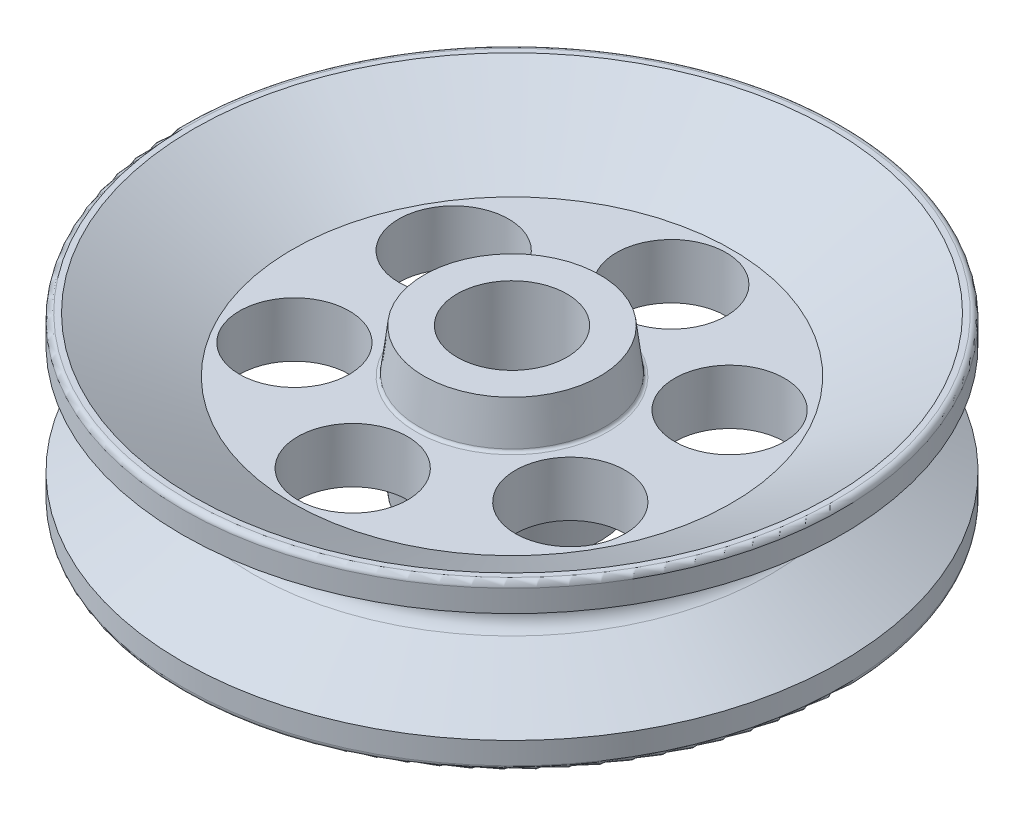
ISO-10303-21;
HEADER;
FILE_DESCRIPTION(('STEP AP214'),'2;1');
FILE_NAME('part.step','',(''),(''),'','','');
FILE_SCHEMA(('AUTOMOTIVE_DESIGN { 1 0 10303 214 1 1 1 1 }'));
ENDSEC;
DATA;
#1=APPLICATION_CONTEXT('core data for automotive mechanical design processes');
#2=APPLICATION_PROTOCOL_DEFINITION('international standard','automotive_design',2000,#1);
#3=PRODUCT_CONTEXT('',#1,'mechanical');
#4=PRODUCT('Part','Part','',(#3));
#5=PRODUCT_RELATED_PRODUCT_CATEGORY('part','',(#4));
#6=PRODUCT_DEFINITION_FORMATION('','',#4);
#7=PRODUCT_DEFINITION_CONTEXT('part definition',#1,'design');
#8=PRODUCT_DEFINITION('design','',#6,#7);
#9=PRODUCT_DEFINITION_SHAPE('','',#8);
#10=(LENGTH_UNIT() NAMED_UNIT(*) SI_UNIT(.MILLI.,.METRE.));
#11=(NAMED_UNIT(*) PLANE_ANGLE_UNIT() SI_UNIT($,.RADIAN.));
#12=(NAMED_UNIT(*) SI_UNIT($,.STERADIAN.) SOLID_ANGLE_UNIT());
#13=UNCERTAINTY_MEASURE_WITH_UNIT(LENGTH_MEASURE(1.E-05),#10,'distance_accuracy_value','');
#14=(GEOMETRIC_REPRESENTATION_CONTEXT(3) GLOBAL_UNCERTAINTY_ASSIGNED_CONTEXT((#13)) GLOBAL_UNIT_ASSIGNED_CONTEXT((#10,
#11,#12)) REPRESENTATION_CONTEXT('',''));
#15=CARTESIAN_POINT('',(0.,0.,0.));
#16=DIRECTION('',(0.,0.,1.));
#17=DIRECTION('',(1.,0.,0.));
#18=AXIS2_PLACEMENT_3D('',#15,#16,#17);
#19=CARTESIAN_POINT('',(0.,-381.,0.));
#20=DIRECTION('',(0.,1.,0.));
#21=DIRECTION('',(0.,0.,1.));
#22=AXIS2_PLACEMENT_3D('',#19,#20,#21);
#23=CYLINDRICAL_SURFACE('',#22,254.);
#24=CARTESIAN_POINT('',(0.,-330.2,0.));
#25=DIRECTION('',(0.,-1.,0.));
#26=DIRECTION('',(0.,0.,-1.));
#27=AXIS2_PLACEMENT_3D('',#24,#25,#26);
#28=CIRCLE('',#27,254.);
#29=CARTESIAN_POINT('',(0.,-330.2,-254.));
#30=VERTEX_POINT('',#29);
#31=EDGE_CURVE('E76',#30,#30,#28,.F.);
#32=ORIENTED_EDGE('',*,*,#31,.F.);
#33=EDGE_LOOP('',(#32));
#34=FACE_BOUND('',#33,.T.);
#35=CARTESIAN_POINT('',(0.,330.2,0.));
#36=DIRECTION('',(0.,1.,0.));
#37=DIRECTION('',(0.,0.,1.));
#38=AXIS2_PLACEMENT_3D('',#35,#36,#37);
#39=CIRCLE('',#38,254.);
#40=CARTESIAN_POINT('',(0.,330.2,254.));
#41=VERTEX_POINT('',#40);
#42=EDGE_CURVE('E64',#41,#41,#39,.F.);
#43=ORIENTED_EDGE('',*,*,#42,.F.);
#44=EDGE_LOOP('',(#43));
#45=FACE_BOUND('',#44,.T.);
#46=ADVANCED_FACE('F39',(#34,#45),#23,.F.);
#47=CARTESIAN_POINT('',(0.,-381.,-736.6));
#48=DIRECTION('',(0.,1.,0.));
#49=DIRECTION('',(0.,0.,1.));
#50=AXIS2_PLACEMENT_3D('',#47,#48,#49);
#51=CYLINDRICAL_SURFACE('',#50,254.);
#52=CARTESIAN_POINT('',(0.,-127.,-736.6));
#53=DIRECTION('',(0.,-1.,0.));
#54=DIRECTION('',(0.,0.,-1.));
#55=AXIS2_PLACEMENT_3D('',#52,#53,#54);
#56=CIRCLE('',#55,254.);
#57=CARTESIAN_POINT('',(0.,-127.,-990.6));
#58=VERTEX_POINT('',#57);
#59=EDGE_CURVE('E81',#58,#58,#56,.F.);
#60=ORIENTED_EDGE('',*,*,#59,.F.);
#61=EDGE_LOOP('',(#60));
#62=FACE_BOUND('',#61,.T.);
#63=CARTESIAN_POINT('',(0.,127.,-736.6));
#64=DIRECTION('',(0.,1.,0.));
#65=DIRECTION('',(0.,0.,1.));
#66=AXIS2_PLACEMENT_3D('',#63,#64,#65);
#67=CIRCLE('',#66,254.);
#68=CARTESIAN_POINT('',(0.,127.,-482.6));
#69=VERTEX_POINT('',#68);
#70=EDGE_CURVE('E69',#69,#69,#67,.F.);
#71=ORIENTED_EDGE('',*,*,#70,.F.);
#72=EDGE_LOOP('',(#71));
#73=FACE_BOUND('',#72,.T.);
#74=ADVANCED_FACE('F197',(#62,#73),#51,.F.);
#75=CARTESIAN_POINT('',(-637.914312427618,-381.,-368.299999999999));
#76=DIRECTION('',(0.,1.,0.));
#77=DIRECTION('',(0.,0.,1.));
#78=AXIS2_PLACEMENT_3D('',#75,#76,#77);
#79=CYLINDRICAL_SURFACE('',#78,254.);
#80=CARTESIAN_POINT('',(-637.914312427618,-127.,-368.299999999999));
#81=DIRECTION('',(0.,-1.,0.));
#82=DIRECTION('',(0.,0.,-1.));
#83=AXIS2_PLACEMENT_3D('',#80,#81,#82);
#84=CIRCLE('',#83,254.);
#85=CARTESIAN_POINT('',(-637.914312427618,-127.,-622.299999999998));
#86=VERTEX_POINT('',#85);
#87=EDGE_CURVE('E105',#86,#86,#84,.F.);
#88=ORIENTED_EDGE('',*,*,#87,.F.);
#89=EDGE_LOOP('',(#88));
#90=FACE_BOUND('',#89,.T.);
#91=CARTESIAN_POINT('',(-637.914312427618,127.,-368.299999999999));
#92=DIRECTION('',(0.,1.,0.));
#93=DIRECTION('',(0.,0.,1.));
#94=AXIS2_PLACEMENT_3D('',#91,#92,#93);
#95=CIRCLE('',#94,254.);
#96=CARTESIAN_POINT('',(-637.914312427618,127.,-114.299999999999));
#97=VERTEX_POINT('',#96);
#98=EDGE_CURVE('E141',#97,#97,#95,.F.);
#99=ORIENTED_EDGE('',*,*,#98,.F.);
#100=EDGE_LOOP('',(#99));
#101=FACE_BOUND('',#100,.T.);
#102=ADVANCED_FACE('F199',(#90,#101),#79,.F.);
#103=CARTESIAN_POINT('',(637.914312427613,-381.,-368.300000000007));
#104=DIRECTION('',(0.,1.,0.));
#105=DIRECTION('',(0.,0.,1.));
#106=AXIS2_PLACEMENT_3D('',#103,#104,#105);
#107=CYLINDRICAL_SURFACE('',#106,254.);
#108=CARTESIAN_POINT('',(637.914312427613,-127.,-368.300000000007));
#109=DIRECTION('',(0.,-1.,0.));
#110=DIRECTION('',(0.,0.,-1.));
#111=AXIS2_PLACEMENT_3D('',#108,#109,#110);
#112=CIRCLE('',#111,254.);
#113=CARTESIAN_POINT('',(637.914312427613,-127.,-622.300000000007));
#114=VERTEX_POINT('',#113);
#115=EDGE_CURVE('E109',#114,#114,#112,.F.);
#116=ORIENTED_EDGE('',*,*,#115,.F.);
#117=EDGE_LOOP('',(#116));
#118=FACE_BOUND('',#117,.T.);
#119=CARTESIAN_POINT('',(637.914312427613,127.,-368.300000000007));
#120=DIRECTION('',(0.,1.,0.));
#121=DIRECTION('',(0.,0.,1.));
#122=AXIS2_PLACEMENT_3D('',#119,#120,#121);
#123=CIRCLE('',#122,254.);
#124=CARTESIAN_POINT('',(637.914312427613,127.,-114.300000000007));
#125=VERTEX_POINT('',#124);
#126=EDGE_CURVE('E145',#125,#125,#123,.F.);
#127=ORIENTED_EDGE('',*,*,#126,.F.);
#128=EDGE_LOOP('',(#127));
#129=FACE_BOUND('',#128,.T.);
#130=ADVANCED_FACE('F206',(#118,#129),#107,.F.);
#131=CARTESIAN_POINT('',(637.914312427621,-381.,368.299999999994));
#132=DIRECTION('',(0.,1.,0.));
#133=DIRECTION('',(0.,0.,1.));
#134=AXIS2_PLACEMENT_3D('',#131,#132,#133);
#135=CYLINDRICAL_SURFACE('',#134,254.);
#136=CARTESIAN_POINT('',(637.914312427621,-127.,368.299999999994));
#137=DIRECTION('',(0.,-1.,0.));
#138=DIRECTION('',(0.,0.,-1.));
#139=AXIS2_PLACEMENT_3D('',#136,#137,#138);
#140=CIRCLE('',#139,254.);
#141=CARTESIAN_POINT('',(637.914312427621,-127.,114.299999999994));
#142=VERTEX_POINT('',#141);
#143=EDGE_CURVE('E113',#142,#142,#140,.F.);
#144=ORIENTED_EDGE('',*,*,#143,.F.);
#145=EDGE_LOOP('',(#144));
#146=FACE_BOUND('',#145,.T.);
#147=CARTESIAN_POINT('',(637.914312427621,127.,368.299999999994));
#148=DIRECTION('',(0.,1.,0.));
#149=DIRECTION('',(0.,0.,1.));
#150=AXIS2_PLACEMENT_3D('',#147,#148,#149);
#151=CIRCLE('',#150,254.);
#152=CARTESIAN_POINT('',(637.914312427621,127.,622.299999999994));
#153=VERTEX_POINT('',#152);
#154=EDGE_CURVE('E149',#153,#153,#151,.F.);
#155=ORIENTED_EDGE('',*,*,#154,.F.);
#156=EDGE_LOOP('',(#155));
#157=FACE_BOUND('',#156,.T.);
#158=ADVANCED_FACE('F297',(#146,#157),#135,.F.);
#159=CARTESIAN_POINT('',(0.,-381.,736.6));
#160=DIRECTION('',(0.,1.,0.));
#161=DIRECTION('',(0.,0.,1.));
#162=AXIS2_PLACEMENT_3D('',#159,#160,#161);
#163=CYLINDRICAL_SURFACE('',#162,254.);
#164=CARTESIAN_POINT('',(0.,-127.,736.6));
#165=DIRECTION('',(0.,-1.,0.));
#166=DIRECTION('',(0.,0.,-1.));
#167=AXIS2_PLACEMENT_3D('',#164,#165,#166);
#168=CIRCLE('',#167,254.);
#169=CARTESIAN_POINT('',(0.,-127.,482.6));
#170=VERTEX_POINT('',#169);
#171=EDGE_CURVE('E86',#170,#170,#168,.F.);
#172=ORIENTED_EDGE('',*,*,#171,.F.);
#173=EDGE_LOOP('',(#172));
#174=FACE_BOUND('',#173,.T.);
#175=CARTESIAN_POINT('',(0.,127.,736.6));
#176=DIRECTION('',(0.,1.,0.));
#177=DIRECTION('',(0.,0.,1.));
#178=AXIS2_PLACEMENT_3D('',#175,#176,#177);
#179=CIRCLE('',#178,254.);
#180=CARTESIAN_POINT('',(0.,127.,990.6));
#181=VERTEX_POINT('',#180);
#182=EDGE_CURVE('E74',#181,#181,#179,.F.);
#183=ORIENTED_EDGE('',*,*,#182,.F.);
#184=EDGE_LOOP('',(#183));
#185=FACE_BOUND('',#184,.T.);
#186=ADVANCED_FACE('F293',(#174,#185),#163,.F.);
#187=CARTESIAN_POINT('',(-637.914312427616,-381.,368.300000000003));
#188=DIRECTION('',(0.,1.,0.));
#189=DIRECTION('',(0.,0.,1.));
#190=AXIS2_PLACEMENT_3D('',#187,#188,#189);
#191=CYLINDRICAL_SURFACE('',#190,254.);
#192=CARTESIAN_POINT('',(-637.914312427616,-127.,368.300000000003));
#193=DIRECTION('',(0.,-1.,0.));
#194=DIRECTION('',(0.,0.,-1.));
#195=AXIS2_PLACEMENT_3D('',#192,#193,#194);
#196=CIRCLE('',#195,254.);
#197=CARTESIAN_POINT('',(-637.914312427616,-127.,114.300000000003));
#198=VERTEX_POINT('',#197);
#199=EDGE_CURVE('E82',#198,#198,#196,.F.);
#200=ORIENTED_EDGE('',*,*,#199,.F.);
#201=EDGE_LOOP('',(#200));
#202=FACE_BOUND('',#201,.T.);
#203=CARTESIAN_POINT('',(-637.914312427616,127.,368.300000000003));
#204=DIRECTION('',(0.,1.,0.));
#205=DIRECTION('',(0.,0.,1.));
#206=AXIS2_PLACEMENT_3D('',#203,#204,#205);
#207=CIRCLE('',#206,254.);
#208=CARTESIAN_POINT('',(-637.914312427616,127.,622.300000000003));
#209=VERTEX_POINT('',#208);
#210=EDGE_CURVE('E70',#209,#209,#207,.F.);
#211=ORIENTED_EDGE('',*,*,#210,.F.);
#212=EDGE_LOOP('',(#211));
#213=FACE_BOUND('',#212,.T.);
#214=ADVANCED_FACE('F236',(#202,#213),#191,.F.);
#215=CARTESIAN_POINT('',(0.,381.,0.));
#216=DIRECTION('',(0.,-1.,0.));
#217=DIRECTION('',(0.,0.,-1.));
#218=AXIS2_PLACEMENT_3D('',#215,#216,#217);
#219=CYLINDRICAL_SURFACE('',#218,1524.);
#220=CARTESIAN_POINT('',(0.,355.6,0.));
#221=DIRECTION('',(0.,1.,0.));
#222=DIRECTION('',(0.,0.,1.));
#223=AXIS2_PLACEMENT_3D('',#220,#221,#222);
#224=CIRCLE('',#223,1524.);
#225=CARTESIAN_POINT('',(0.,355.6,1524.));
#226=VERTEX_POINT('',#225);
#227=EDGE_CURVE('E52',#226,#226,#224,.F.);
#228=ORIENTED_EDGE('',*,*,#227,.T.);
#229=EDGE_LOOP('',(#228));
#230=FACE_BOUND('',#229,.T.);
#231=CARTESIAN_POINT('',(0.,254.,0.));
#232=DIRECTION('',(0.,1.,0.));
#233=DIRECTION('',(0.,0.,1.));
#234=AXIS2_PLACEMENT_3D('',#231,#232,#233);
#235=CIRCLE('',#234,1524.);
#236=CARTESIAN_POINT('',(0.,254.,1524.));
#237=VERTEX_POINT('',#236);
#238=EDGE_CURVE('E80',#237,#237,#235,.T.);
#239=ORIENTED_EDGE('',*,*,#238,.T.);
#240=EDGE_LOOP('',(#239));
#241=FACE_BOUND('',#240,.T.);
#242=ADVANCED_FACE('F230',(#230,#241),#219,.T.);
#243=CARTESIAN_POINT('',(0.,381.,0.));
#244=DIRECTION('',(0.,1.,0.));
#245=DIRECTION('',(0.,0.,1.));
#246=AXIS2_PLACEMENT_3D('',#243,#244,#245);
#247=PLANE('',#246);
#248=CARTESIAN_POINT('',(0.,381.,0.));
#249=DIRECTION('',(0.,1.,0.));
#250=DIRECTION('',(0.,0.,1.));
#251=AXIS2_PLACEMENT_3D('',#248,#249,#250);
#252=CIRCLE('',#251,1498.6);
#253=CARTESIAN_POINT('',(0.,381.,1498.6));
#254=VERTEX_POINT('',#253);
#255=EDGE_CURVE('E57',#254,#254,#252,.T.);
#256=ORIENTED_EDGE('',*,*,#255,.T.);
#257=EDGE_LOOP('',(#256));
#258=FACE_BOUND('',#257,.T.);
#259=CARTESIAN_POINT('',(0.,381.,0.));
#260=DIRECTION('',(0.,1.,0.));
#261=DIRECTION('',(0.,0.,1.));
#262=AXIS2_PLACEMENT_3D('',#259,#260,#261);
#263=CIRCLE('',#262,1473.2);
#264=CARTESIAN_POINT('',(0.,381.,1473.2));
#265=VERTEX_POINT('',#264);
#266=EDGE_CURVE('E163',#265,#265,#263,.T.);
#267=ORIENTED_EDGE('',*,*,#266,.F.);
#268=EDGE_LOOP('',(#267));
#269=FACE_BOUND('',#268,.T.);
#270=ADVANCED_FACE('F226',(#258,#269),#247,.T.);
#271=CARTESIAN_POINT('',(0.,254.,0.));
#272=DIRECTION('',(0.,1.,0.));
#273=DIRECTION('',(0.,0.,1.));
#274=AXIS2_PLACEMENT_3D('',#271,#272,#273);
#275=CONICAL_SURFACE('',#274,1524.,1.0471975511966);
#276=CARTESIAN_POINT('',(0.,65.9911357683741,0.));
#277=DIRECTION('',(0.,1.,0.));
#278=DIRECTION('',(0.,0.,1.));
#279=AXIS2_PLACEMENT_3D('',#276,#277,#278);
#280=CIRCLE('',#279,1198.35909487751);
#281=CARTESIAN_POINT('',(0.,65.9911357683741,1198.35909487751));
#282=VERTEX_POINT('',#281);
#283=EDGE_CURVE('E63',#282,#282,#280,.T.);
#284=ORIENTED_EDGE('',*,*,#283,.T.);
#285=EDGE_LOOP('',(#284));
#286=FACE_BOUND('',#285,.T.);
#287=ORIENTED_EDGE('',*,*,#238,.F.);
#288=EDGE_LOOP('',(#287));
#289=FACE_BOUND('',#288,.T.);
#290=ADVANCED_FACE('F222',(#286,#289),#275,.T.);
#291=CARTESIAN_POINT('',(0.,0.,0.));
#292=DIRECTION('',(0.,1.,0.));
#293=DIRECTION('',(0.,0.,1.));
#294=AXIS2_PLACEMENT_3D('',#291,#292,#293);
#295=TOROIDAL_SURFACE('',#294,1236.45909487751,76.2);
#296=CARTESIAN_POINT('',(0.,-65.9911357683741,0.));
#297=DIRECTION('',(0.,1.,0.));
#298=DIRECTION('',(0.,0.,1.));
#299=AXIS2_PLACEMENT_3D('',#296,#297,#298);
#300=CIRCLE('',#299,1198.35909487751);
#301=CARTESIAN_POINT('',(0.,-65.9911357683741,1198.35909487751));
#302=VERTEX_POINT('',#301);
#303=EDGE_CURVE('E91',#302,#302,#300,.T.);
#304=ORIENTED_EDGE('',*,*,#303,.T.);
#305=EDGE_LOOP('',(#304));
#306=FACE_BOUND('',#305,.T.);
#307=ORIENTED_EDGE('',*,*,#283,.F.);
#308=EDGE_LOOP('',(#307));
#309=FACE_BOUND('',#308,.T.);
#310=ADVANCED_FACE('F218',(#306,#309),#295,.F.);
#311=CARTESIAN_POINT('',(0.,-65.9911357683741,0.));
#312=DIRECTION('',(0.,-1.,0.));
#313=DIRECTION('',(0.,0.,-1.));
#314=AXIS2_PLACEMENT_3D('',#311,#312,#313);
#315=CONICAL_SURFACE('',#314,1198.35909487751,1.0471975511966);
#316=CARTESIAN_POINT('',(0.,-254.,0.));
#317=DIRECTION('',(0.,1.,0.));
#318=DIRECTION('',(0.,0.,1.));
#319=AXIS2_PLACEMENT_3D('',#316,#317,#318);
#320=CIRCLE('',#319,1524.);
#321=CARTESIAN_POINT('',(0.,-254.,1524.));
#322=VERTEX_POINT('',#321);
#323=EDGE_CURVE('E95',#322,#322,#320,.T.);
#324=ORIENTED_EDGE('',*,*,#323,.T.);
#325=EDGE_LOOP('',(#324));
#326=FACE_BOUND('',#325,.T.);
#327=ORIENTED_EDGE('',*,*,#303,.F.);
#328=EDGE_LOOP('',(#327));
#329=FACE_BOUND('',#328,.T.);
#330=ADVANCED_FACE('F214',(#326,#329),#315,.T.);
#331=CARTESIAN_POINT('',(0.,-381.,0.));
#332=DIRECTION('',(0.,1.,0.));
#333=DIRECTION('',(0.,0.,1.));
#334=AXIS2_PLACEMENT_3D('',#331,#332,#333);
#335=PLANE('',#334);
#336=CARTESIAN_POINT('',(0.,-381.,0.));
#337=DIRECTION('',(0.,1.,0.));
#338=DIRECTION('',(0.,0.,1.));
#339=AXIS2_PLACEMENT_3D('',#336,#337,#338);
#340=CIRCLE('',#339,1498.6);
#341=CARTESIAN_POINT('',(0.,-381.,1498.6));
#342=VERTEX_POINT('',#341);
#343=EDGE_CURVE('E10',#342,#342,#340,.F.);
#344=ORIENTED_EDGE('',*,*,#343,.T.);
#345=EDGE_LOOP('',(#344));
#346=FACE_BOUND('',#345,.T.);
#347=CARTESIAN_POINT('',(0.,-381.,0.));
#348=DIRECTION('',(0.,1.,0.));
#349=DIRECTION('',(0.,0.,1.));
#350=AXIS2_PLACEMENT_3D('',#347,#348,#349);
#351=CIRCLE('',#350,1473.2);
#352=CARTESIAN_POINT('',(0.,-381.,1473.2));
#353=VERTEX_POINT('',#352);
#354=EDGE_CURVE('E87',#353,#353,#351,.T.);
#355=ORIENTED_EDGE('',*,*,#354,.T.);
#356=EDGE_LOOP('',(#355));
#357=FACE_BOUND('',#356,.T.);
#358=ADVANCED_FACE('F217',(#346,#357),#335,.F.);
#359=CARTESIAN_POINT('',(0.,-355.6,0.));
#360=DIRECTION('',(0.,1.,0.));
#361=DIRECTION('',(0.,0.,1.));
#362=AXIS2_PLACEMENT_3D('',#359,#360,#361);
#363=CIRCLE('',#362,1524.);
#364=CARTESIAN_POINT('',(0.,-355.6,1524.));
#365=VERTEX_POINT('',#364);
#366=EDGE_CURVE('E47',#365,#365,#363,.T.);
#367=ORIENTED_EDGE('',*,*,#366,.T.);
#368=EDGE_LOOP('',(#367));
#369=FACE_BOUND('',#368,.T.);
#370=ORIENTED_EDGE('',*,*,#323,.F.);
#371=EDGE_LOOP('',(#370));
#372=FACE_BOUND('',#371,.T.);
#373=ADVANCED_FACE('F234',(#369,#372),#219,.T.);
#374=CARTESIAN_POINT('',(0.,-330.2,0.));
#375=DIRECTION('',(0.,-1.,0.));
#376=DIRECTION('',(0.,0.,-1.));
#377=AXIS2_PLACEMENT_3D('',#374,#375,#376);
#378=PLANE('',#377);
#379=CARTESIAN_POINT('',(0.,-330.2,0.));
#380=DIRECTION('',(0.,1.,0.));
#381=DIRECTION('',(0.,0.,1.));
#382=AXIS2_PLACEMENT_3D('',#379,#380,#381);
#383=CIRCLE('',#382,406.4);
#384=CARTESIAN_POINT('',(0.,-330.2,406.4));
#385=VERTEX_POINT('',#384);
#386=EDGE_CURVE('E68',#385,#385,#383,.T.);
#387=ORIENTED_EDGE('',*,*,#386,.F.);
#388=EDGE_LOOP('',(#387));
#389=FACE_BOUND('',#388,.T.);
#390=ORIENTED_EDGE('',*,*,#31,.T.);
#391=EDGE_LOOP('',(#390));
#392=FACE_BOUND('',#391,.T.);
#393=ADVANCED_FACE('F283',(#389,#392),#378,.T.);
#394=CARTESIAN_POINT('',(0.,-127.,-1016.));
#395=DIRECTION('',(0.,-1.,0.));
#396=DIRECTION('',(0.,0.,-1.));
#397=AXIS2_PLACEMENT_3D('',#394,#395,#396);
#398=PLANE('',#397);
#399=CARTESIAN_POINT('',(0.,-127.,0.));
#400=DIRECTION('',(0.,1.,0.));
#401=DIRECTION('',(0.,0.,1.));
#402=AXIS2_PLACEMENT_3D('',#399,#400,#401);
#403=CIRCLE('',#402,444.5);
#404=CARTESIAN_POINT('',(0.,-127.,444.5));
#405=VERTEX_POINT('',#404);
#406=EDGE_CURVE('E127',#405,#405,#403,.T.);
#407=ORIENTED_EDGE('',*,*,#406,.T.);
#408=EDGE_LOOP('',(#407));
#409=FACE_BOUND('',#408,.T.);
#410=CARTESIAN_POINT('',(0.,-127.,0.));
#411=DIRECTION('',(0.,1.,0.));
#412=DIRECTION('',(0.,0.,1.));
#413=AXIS2_PLACEMENT_3D('',#410,#411,#412);
#414=CIRCLE('',#413,1016.);
#415=CARTESIAN_POINT('',(0.,-127.,1016.));
#416=VERTEX_POINT('',#415);
#417=EDGE_CURVE('E123',#416,#416,#414,.T.);
#418=ORIENTED_EDGE('',*,*,#417,.F.);
#419=EDGE_LOOP('',(#418));
#420=FACE_BOUND('',#419,.T.);
#421=ORIENTED_EDGE('',*,*,#199,.T.);
#422=EDGE_LOOP('',(#421));
#423=FACE_BOUND('',#422,.T.);
#424=ORIENTED_EDGE('',*,*,#171,.T.);
#425=EDGE_LOOP('',(#424));
#426=FACE_BOUND('',#425,.T.);
#427=ORIENTED_EDGE('',*,*,#143,.T.);
#428=EDGE_LOOP('',(#427));
#429=FACE_BOUND('',#428,.T.);
#430=ORIENTED_EDGE('',*,*,#115,.T.);
#431=EDGE_LOOP('',(#430));
#432=FACE_BOUND('',#431,.T.);
#433=ORIENTED_EDGE('',*,*,#87,.T.);
#434=EDGE_LOOP('',(#433));
#435=FACE_BOUND('',#434,.T.);
#436=ORIENTED_EDGE('',*,*,#59,.T.);
#437=EDGE_LOOP('',(#436));
#438=FACE_BOUND('',#437,.T.);
#439=ADVANCED_FACE('F280',(#409,#420,#423,#426,#429,#432,#435,#438),#398,.T.);
#440=CARTESIAN_POINT('',(0.,-381.,0.));
#441=DIRECTION('',(0.,-1.,0.));
#442=DIRECTION('',(0.,0.,-1.));
#443=AXIS2_PLACEMENT_3D('',#440,#441,#442);
#444=CONICAL_SURFACE('',#443,1473.2,1.06369782240256);
#445=ORIENTED_EDGE('',*,*,#417,.T.);
#446=EDGE_LOOP('',(#445));
#447=FACE_BOUND('',#446,.T.);
#448=ORIENTED_EDGE('',*,*,#354,.F.);
#449=EDGE_LOOP('',(#448));
#450=FACE_BOUND('',#449,.T.);
#451=ADVANCED_FACE('F278',(#447,#450),#444,.F.);
#452=CARTESIAN_POINT('',(0.,-141.47353357562,0.));
#453=DIRECTION('',(0.,1.,0.));
#454=DIRECTION('',(0.,0.,1.));
#455=AXIS2_PLACEMENT_3D('',#452,#453,#454);
#456=TOROIDAL_SURFACE('',#455,444.5,14.4735335756199);
#457=CARTESIAN_POINT('',(0.,-139.684026624641,0.));
#458=DIRECTION('',(0.,1.,0.));
#459=DIRECTION('',(0.,0.,1.));
#460=AXIS2_PLACEMENT_3D('',#457,#458,#459);
#461=CIRCLE('',#460,430.137519746332);
#462=CARTESIAN_POINT('',(0.,-139.684026624641,430.137519746332));
#463=VERTEX_POINT('',#462);
#464=EDGE_CURVE('E131',#463,#463,#461,.T.);
#465=ORIENTED_EDGE('',*,*,#464,.T.);
#466=EDGE_LOOP('',(#465));
#467=FACE_BOUND('',#466,.T.);
#468=ORIENTED_EDGE('',*,*,#406,.F.);
#469=EDGE_LOOP('',(#468));
#470=FACE_BOUND('',#469,.T.);
#471=ADVANCED_FACE('F274',(#467,#470),#456,.F.);
#472=CARTESIAN_POINT('',(0.,-139.684026624641,0.));
#473=DIRECTION('',(0.,1.,0.));
#474=DIRECTION('',(0.,0.,1.));
#475=AXIS2_PLACEMENT_3D('',#472,#473,#474);
#476=CONICAL_SURFACE('',#475,430.137519746332,0.123957146381599);
#477=ORIENTED_EDGE('',*,*,#386,.T.);
#478=EDGE_LOOP('',(#477));
#479=FACE_BOUND('',#478,.T.);
#480=ORIENTED_EDGE('',*,*,#464,.F.);
#481=EDGE_LOOP('',(#480));
#482=FACE_BOUND('',#481,.T.);
#483=ADVANCED_FACE('F267',(#479,#482),#476,.T.);
#484=CARTESIAN_POINT('',(0.,330.2,0.));
#485=DIRECTION('',(0.,1.,0.));
#486=DIRECTION('',(0.,0.,1.));
#487=AXIS2_PLACEMENT_3D('',#484,#485,#486);
#488=PLANE('',#487);
#489=CARTESIAN_POINT('',(0.,330.2,0.));
#490=DIRECTION('',(0.,1.,0.));
#491=DIRECTION('',(0.,0.,1.));
#492=AXIS2_PLACEMENT_3D('',#489,#490,#491);
#493=CIRCLE('',#492,406.4);
#494=CARTESIAN_POINT('',(0.,330.2,406.4));
#495=VERTEX_POINT('',#494);
#496=EDGE_CURVE('E159',#495,#495,#493,.T.);
#497=ORIENTED_EDGE('',*,*,#496,.T.);
#498=EDGE_LOOP('',(#497));
#499=FACE_BOUND('',#498,.T.);
#500=ORIENTED_EDGE('',*,*,#42,.T.);
#501=EDGE_LOOP('',(#500));
#502=FACE_BOUND('',#501,.T.);
#503=ADVANCED_FACE('F182',(#499,#502),#488,.T.);
#504=CARTESIAN_POINT('',(0.,127.,-1016.));
#505=DIRECTION('',(0.,1.,0.));
#506=DIRECTION('',(0.,0.,1.));
#507=AXIS2_PLACEMENT_3D('',#504,#505,#506);
#508=PLANE('',#507);
#509=CARTESIAN_POINT('',(0.,127.,0.));
#510=DIRECTION('',(0.,1.,0.));
#511=DIRECTION('',(0.,0.,1.));
#512=AXIS2_PLACEMENT_3D('',#509,#510,#511);
#513=CIRCLE('',#512,1016.);
#514=CARTESIAN_POINT('',(0.,127.,1016.));
#515=VERTEX_POINT('',#514);
#516=EDGE_CURVE('E167',#515,#515,#513,.T.);
#517=ORIENTED_EDGE('',*,*,#516,.T.);
#518=EDGE_LOOP('',(#517));
#519=FACE_BOUND('',#518,.T.);
#520=CARTESIAN_POINT('',(0.,127.,0.));
#521=DIRECTION('',(0.,1.,0.));
#522=DIRECTION('',(0.,0.,1.));
#523=AXIS2_PLACEMENT_3D('',#520,#521,#522);
#524=CIRCLE('',#523,444.5);
#525=CARTESIAN_POINT('',(0.,127.,444.5));
#526=VERTEX_POINT('',#525);
#527=EDGE_CURVE('E171',#526,#526,#524,.T.);
#528=ORIENTED_EDGE('',*,*,#527,.F.);
#529=EDGE_LOOP('',(#528));
#530=FACE_BOUND('',#529,.T.);
#531=ORIENTED_EDGE('',*,*,#210,.T.);
#532=EDGE_LOOP('',(#531));
#533=FACE_BOUND('',#532,.T.);
#534=ORIENTED_EDGE('',*,*,#182,.T.);
#535=EDGE_LOOP('',(#534));
#536=FACE_BOUND('',#535,.T.);
#537=ORIENTED_EDGE('',*,*,#154,.T.);
#538=EDGE_LOOP('',(#537));
#539=FACE_BOUND('',#538,.T.);
#540=ORIENTED_EDGE('',*,*,#126,.T.);
#541=EDGE_LOOP('',(#540));
#542=FACE_BOUND('',#541,.T.);
#543=ORIENTED_EDGE('',*,*,#98,.T.);
#544=EDGE_LOOP('',(#543));
#545=FACE_BOUND('',#544,.T.);
#546=ORIENTED_EDGE('',*,*,#70,.T.);
#547=EDGE_LOOP('',(#546));
#548=FACE_BOUND('',#547,.T.);
#549=ADVANCED_FACE('F179',(#519,#530,#533,#536,#539,#542,#545,#548),#508,.T.);
#550=CARTESIAN_POINT('',(0.,141.47353357562,0.));
#551=DIRECTION('',(0.,1.,0.));
#552=DIRECTION('',(0.,0.,1.));
#553=AXIS2_PLACEMENT_3D('',#550,#551,#552);
#554=TOROIDAL_SURFACE('',#553,444.5,14.4735335756199);
#555=ORIENTED_EDGE('',*,*,#527,.T.);
#556=EDGE_LOOP('',(#555));
#557=FACE_BOUND('',#556,.T.);
#558=CARTESIAN_POINT('',(0.,139.684026624641,0.));
#559=DIRECTION('',(0.,1.,0.));
#560=DIRECTION('',(0.,0.,1.));
#561=AXIS2_PLACEMENT_3D('',#558,#559,#560);
#562=CIRCLE('',#561,430.137519746333);
#563=CARTESIAN_POINT('',(0.,139.684026624641,430.137519746333));
#564=VERTEX_POINT('',#563);
#565=EDGE_CURVE('E75',#564,#564,#562,.T.);
#566=ORIENTED_EDGE('',*,*,#565,.F.);
#567=EDGE_LOOP('',(#566));
#568=FACE_BOUND('',#567,.T.);
#569=ADVANCED_FACE('F176',(#557,#568),#554,.F.);
#570=CARTESIAN_POINT('',(0.,330.2,0.));
#571=DIRECTION('',(0.,-1.,0.));
#572=DIRECTION('',(0.,0.,-1.));
#573=AXIS2_PLACEMENT_3D('',#570,#571,#572);
#574=CONICAL_SURFACE('',#573,406.4,0.123957146381601);
#575=ORIENTED_EDGE('',*,*,#565,.T.);
#576=EDGE_LOOP('',(#575));
#577=FACE_BOUND('',#576,.T.);
#578=ORIENTED_EDGE('',*,*,#496,.F.);
#579=EDGE_LOOP('',(#578));
#580=FACE_BOUND('',#579,.T.);
#581=ADVANCED_FACE('F247',(#577,#580),#574,.T.);
#582=CARTESIAN_POINT('',(0.,127.,0.));
#583=DIRECTION('',(0.,1.,0.));
#584=DIRECTION('',(0.,0.,1.));
#585=AXIS2_PLACEMENT_3D('',#582,#583,#584);
#586=CONICAL_SURFACE('',#585,1016.,1.06369782240256);
#587=ORIENTED_EDGE('',*,*,#266,.T.);
#588=EDGE_LOOP('',(#587));
#589=FACE_BOUND('',#588,.T.);
#590=ORIENTED_EDGE('',*,*,#516,.F.);
#591=EDGE_LOOP('',(#590));
#592=FACE_BOUND('',#591,.T.);
#593=ADVANCED_FACE('F240',(#589,#592),#586,.F.);
#594=CARTESIAN_POINT('',(0.,355.6,0.));
#595=DIRECTION('',(0.,1.,0.));
#596=DIRECTION('',(0.,0.,1.));
#597=AXIS2_PLACEMENT_3D('',#594,#595,#596);
#598=TOROIDAL_SURFACE('',#597,1498.6,25.4);
#599=ORIENTED_EDGE('',*,*,#227,.F.);
#600=EDGE_LOOP('',(#599));
#601=FACE_BOUND('',#600,.T.);
#602=ORIENTED_EDGE('',*,*,#255,.F.);
#603=EDGE_LOOP('',(#602));
#604=FACE_BOUND('',#603,.T.);
#605=ADVANCED_FACE('F238',(#601,#604),#598,.T.);
#606=CARTESIAN_POINT('',(0.,-355.6,0.));
#607=DIRECTION('',(0.,1.,0.));
#608=DIRECTION('',(0.,0.,1.));
#609=AXIS2_PLACEMENT_3D('',#606,#607,#608);
#610=TOROIDAL_SURFACE('',#609,1498.6,25.4);
#611=ORIENTED_EDGE('',*,*,#343,.F.);
#612=EDGE_LOOP('',(#611));
#613=FACE_BOUND('',#612,.T.);
#614=ORIENTED_EDGE('',*,*,#366,.F.);
#615=EDGE_LOOP('',(#614));
#616=FACE_BOUND('',#615,.T.);
#617=ADVANCED_FACE('F41',(#613,#616),#610,.T.);
#618=CLOSED_SHELL('',(#46,#74,#102,#130,#158,#186,#214,#242,#270,#290,#310,#330,#358,#373,#393,
#439,#451,#471,#483,#503,#549,#569,#581,#593,#605,#617));
#619=MANIFOLD_SOLID_BREP('B2',#618);
#620=ADVANCED_BREP_SHAPE_REPRESENTATION('',(#18,#619),#14);
#621=SHAPE_DEFINITION_REPRESENTATION(#9,#620);
ENDSEC;
END-ISO-10303-21;
